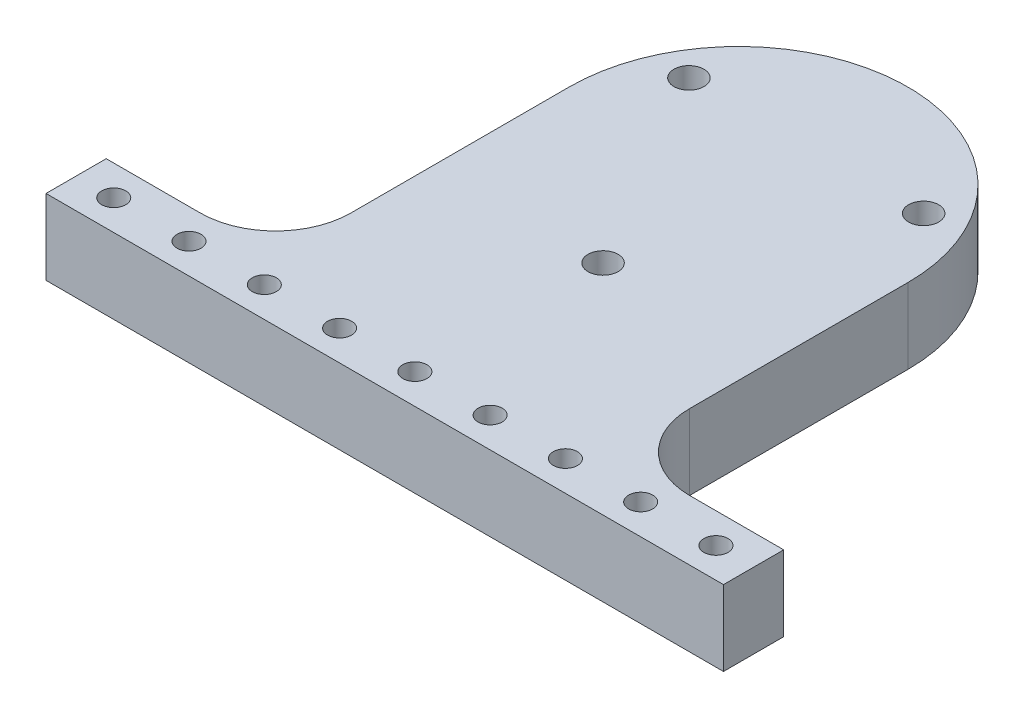
ISO-10303-21;
HEADER;
FILE_DESCRIPTION(('STEP AP214'),'2;1');
FILE_NAME('part.step','',(''),(''),'','','');
FILE_SCHEMA(('AUTOMOTIVE_DESIGN { 1 0 10303 214 1 1 1 1 }'));
ENDSEC;
DATA;
#1=APPLICATION_CONTEXT('core data for automotive mechanical design processes');
#2=APPLICATION_PROTOCOL_DEFINITION('international standard','automotive_design',2000,#1);
#3=PRODUCT_CONTEXT('',#1,'mechanical');
#4=PRODUCT('Part','Part','',(#3));
#5=PRODUCT_RELATED_PRODUCT_CATEGORY('part','',(#4));
#6=PRODUCT_DEFINITION_FORMATION('','',#4);
#7=PRODUCT_DEFINITION_CONTEXT('part definition',#1,'design');
#8=PRODUCT_DEFINITION('design','',#6,#7);
#9=PRODUCT_DEFINITION_SHAPE('','',#8);
#10=(LENGTH_UNIT() NAMED_UNIT(*) SI_UNIT(.MILLI.,.METRE.));
#11=(NAMED_UNIT(*) PLANE_ANGLE_UNIT() SI_UNIT($,.RADIAN.));
#12=(NAMED_UNIT(*) SI_UNIT($,.STERADIAN.) SOLID_ANGLE_UNIT());
#13=UNCERTAINTY_MEASURE_WITH_UNIT(LENGTH_MEASURE(1.E-05),#10,'distance_accuracy_value','');
#14=(GEOMETRIC_REPRESENTATION_CONTEXT(3) GLOBAL_UNCERTAINTY_ASSIGNED_CONTEXT((#13)) GLOBAL_UNIT_ASSIGNED_CONTEXT((#10,
#11,#12)) REPRESENTATION_CONTEXT('',''));
#15=CARTESIAN_POINT('',(0.,0.,0.));
#16=DIRECTION('',(0.,0.,1.));
#17=DIRECTION('',(1.,0.,0.));
#18=AXIS2_PLACEMENT_3D('',#15,#16,#17);
#19=CARTESIAN_POINT('',(40.,0.,0.));
#20=DIRECTION('',(0.,1.,0.));
#21=DIRECTION('',(0.,0.,1.));
#22=AXIS2_PLACEMENT_3D('',#19,#20,#21);
#23=CYLINDRICAL_SURFACE('',#22,1.6);
#24=CARTESIAN_POINT('',(40.,0.,0.));
#25=DIRECTION('',(0.,1.,0.));
#26=DIRECTION('',(0.,0.,1.));
#27=AXIS2_PLACEMENT_3D('',#24,#25,#26);
#28=CIRCLE('',#27,1.6);
#29=CARTESIAN_POINT('',(40.,0.,1.6));
#30=VERTEX_POINT('',#29);
#31=EDGE_CURVE('E44',#30,#30,#28,.T.);
#32=ORIENTED_EDGE('',*,*,#31,.F.);
#33=EDGE_LOOP('',(#32));
#34=FACE_BOUND('',#33,.T.);
#35=CARTESIAN_POINT('',(40.,10.,0.));
#36=DIRECTION('',(0.,1.,0.));
#37=DIRECTION('',(0.,0.,1.));
#38=AXIS2_PLACEMENT_3D('',#35,#36,#37);
#39=CIRCLE('',#38,1.6);
#40=CARTESIAN_POINT('',(40.,10.,1.6));
#41=VERTEX_POINT('',#40);
#42=EDGE_CURVE('E11',#41,#41,#39,.T.);
#43=ORIENTED_EDGE('',*,*,#42,.T.);
#44=EDGE_LOOP('',(#43));
#45=FACE_BOUND('',#44,.T.);
#46=ADVANCED_FACE('F37',(#34,#45),#23,.F.);
#47=CARTESIAN_POINT('',(30.,0.,0.));
#48=DIRECTION('',(0.,1.,0.));
#49=DIRECTION('',(0.,0.,1.));
#50=AXIS2_PLACEMENT_3D('',#47,#48,#49);
#51=CYLINDRICAL_SURFACE('',#50,1.6);
#52=CARTESIAN_POINT('',(30.,0.,0.));
#53=DIRECTION('',(0.,1.,0.));
#54=DIRECTION('',(0.,0.,1.));
#55=AXIS2_PLACEMENT_3D('',#52,#53,#54);
#56=CIRCLE('',#55,1.6);
#57=CARTESIAN_POINT('',(30.,0.,1.6));
#58=VERTEX_POINT('',#57);
#59=EDGE_CURVE('E227',#58,#58,#56,.T.);
#60=ORIENTED_EDGE('',*,*,#59,.F.);
#61=EDGE_LOOP('',(#60));
#62=FACE_BOUND('',#61,.T.);
#63=CARTESIAN_POINT('',(30.,10.,0.));
#64=DIRECTION('',(0.,1.,0.));
#65=DIRECTION('',(0.,0.,1.));
#66=AXIS2_PLACEMENT_3D('',#63,#64,#65);
#67=CIRCLE('',#66,1.6);
#68=CARTESIAN_POINT('',(30.,10.,1.6));
#69=VERTEX_POINT('',#68);
#70=EDGE_CURVE('E230',#69,#69,#67,.T.);
#71=ORIENTED_EDGE('',*,*,#70,.T.);
#72=EDGE_LOOP('',(#71));
#73=FACE_BOUND('',#72,.T.);
#74=ADVANCED_FACE('F238',(#62,#73),#51,.F.);
#75=CARTESIAN_POINT('',(20.,0.,0.));
#76=DIRECTION('',(0.,1.,0.));
#77=DIRECTION('',(0.,0.,1.));
#78=AXIS2_PLACEMENT_3D('',#75,#76,#77);
#79=CYLINDRICAL_SURFACE('',#78,1.6);
#80=CARTESIAN_POINT('',(20.,0.,0.));
#81=DIRECTION('',(0.,1.,0.));
#82=DIRECTION('',(0.,0.,1.));
#83=AXIS2_PLACEMENT_3D('',#80,#81,#82);
#84=CIRCLE('',#83,1.6);
#85=CARTESIAN_POINT('',(20.,0.,1.6));
#86=VERTEX_POINT('',#85);
#87=EDGE_CURVE('E221',#86,#86,#84,.T.);
#88=ORIENTED_EDGE('',*,*,#87,.F.);
#89=EDGE_LOOP('',(#88));
#90=FACE_BOUND('',#89,.T.);
#91=CARTESIAN_POINT('',(20.,10.,0.));
#92=DIRECTION('',(0.,1.,0.));
#93=DIRECTION('',(0.,0.,1.));
#94=AXIS2_PLACEMENT_3D('',#91,#92,#93);
#95=CIRCLE('',#94,1.6);
#96=CARTESIAN_POINT('',(20.,10.,1.6));
#97=VERTEX_POINT('',#96);
#98=EDGE_CURVE('E224',#97,#97,#95,.T.);
#99=ORIENTED_EDGE('',*,*,#98,.T.);
#100=EDGE_LOOP('',(#99));
#101=FACE_BOUND('',#100,.T.);
#102=ADVANCED_FACE('F298',(#90,#101),#79,.F.);
#103=CARTESIAN_POINT('',(10.,0.,0.));
#104=DIRECTION('',(0.,1.,0.));
#105=DIRECTION('',(0.,0.,1.));
#106=AXIS2_PLACEMENT_3D('',#103,#104,#105);
#107=CYLINDRICAL_SURFACE('',#106,1.6);
#108=CARTESIAN_POINT('',(10.,0.,0.));
#109=DIRECTION('',(0.,1.,0.));
#110=DIRECTION('',(0.,0.,1.));
#111=AXIS2_PLACEMENT_3D('',#108,#109,#110);
#112=CIRCLE('',#111,1.6);
#113=CARTESIAN_POINT('',(10.,0.,1.6));
#114=VERTEX_POINT('',#113);
#115=EDGE_CURVE('E215',#114,#114,#112,.T.);
#116=ORIENTED_EDGE('',*,*,#115,.F.);
#117=EDGE_LOOP('',(#116));
#118=FACE_BOUND('',#117,.T.);
#119=CARTESIAN_POINT('',(10.,10.,0.));
#120=DIRECTION('',(0.,1.,0.));
#121=DIRECTION('',(0.,0.,1.));
#122=AXIS2_PLACEMENT_3D('',#119,#120,#121);
#123=CIRCLE('',#122,1.6);
#124=CARTESIAN_POINT('',(10.,10.,1.6));
#125=VERTEX_POINT('',#124);
#126=EDGE_CURVE('E218',#125,#125,#123,.T.);
#127=ORIENTED_EDGE('',*,*,#126,.T.);
#128=EDGE_LOOP('',(#127));
#129=FACE_BOUND('',#128,.T.);
#130=ADVANCED_FACE('F294',(#118,#129),#107,.F.);
#131=CARTESIAN_POINT('',(0.,0.,0.));
#132=DIRECTION('',(0.,1.,0.));
#133=DIRECTION('',(0.,0.,1.));
#134=AXIS2_PLACEMENT_3D('',#131,#132,#133);
#135=CYLINDRICAL_SURFACE('',#134,1.6);
#136=CARTESIAN_POINT('',(0.,0.,0.));
#137=DIRECTION('',(0.,1.,0.));
#138=DIRECTION('',(0.,0.,1.));
#139=AXIS2_PLACEMENT_3D('',#136,#137,#138);
#140=CIRCLE('',#139,1.6);
#141=CARTESIAN_POINT('',(0.,0.,1.6));
#142=VERTEX_POINT('',#141);
#143=EDGE_CURVE('E209',#142,#142,#140,.T.);
#144=ORIENTED_EDGE('',*,*,#143,.F.);
#145=EDGE_LOOP('',(#144));
#146=FACE_BOUND('',#145,.T.);
#147=CARTESIAN_POINT('',(0.,10.,0.));
#148=DIRECTION('',(0.,1.,0.));
#149=DIRECTION('',(0.,0.,1.));
#150=AXIS2_PLACEMENT_3D('',#147,#148,#149);
#151=CIRCLE('',#150,1.6);
#152=CARTESIAN_POINT('',(0.,10.,1.6));
#153=VERTEX_POINT('',#152);
#154=EDGE_CURVE('E212',#153,#153,#151,.T.);
#155=ORIENTED_EDGE('',*,*,#154,.T.);
#156=EDGE_LOOP('',(#155));
#157=FACE_BOUND('',#156,.T.);
#158=ADVANCED_FACE('F290',(#146,#157),#135,.F.);
#159=CARTESIAN_POINT('',(-10.,0.,0.));
#160=DIRECTION('',(0.,1.,0.));
#161=DIRECTION('',(0.,0.,1.));
#162=AXIS2_PLACEMENT_3D('',#159,#160,#161);
#163=CYLINDRICAL_SURFACE('',#162,1.6);
#164=CARTESIAN_POINT('',(-10.,0.,0.));
#165=DIRECTION('',(0.,1.,0.));
#166=DIRECTION('',(0.,0.,1.));
#167=AXIS2_PLACEMENT_3D('',#164,#165,#166);
#168=CIRCLE('',#167,1.6);
#169=CARTESIAN_POINT('',(-10.,0.,1.6));
#170=VERTEX_POINT('',#169);
#171=EDGE_CURVE('E203',#170,#170,#168,.T.);
#172=ORIENTED_EDGE('',*,*,#171,.F.);
#173=EDGE_LOOP('',(#172));
#174=FACE_BOUND('',#173,.T.);
#175=CARTESIAN_POINT('',(-10.,10.,0.));
#176=DIRECTION('',(0.,1.,0.));
#177=DIRECTION('',(0.,0.,1.));
#178=AXIS2_PLACEMENT_3D('',#175,#176,#177);
#179=CIRCLE('',#178,1.6);
#180=CARTESIAN_POINT('',(-10.,10.,1.6));
#181=VERTEX_POINT('',#180);
#182=EDGE_CURVE('E206',#181,#181,#179,.T.);
#183=ORIENTED_EDGE('',*,*,#182,.T.);
#184=EDGE_LOOP('',(#183));
#185=FACE_BOUND('',#184,.T.);
#186=ADVANCED_FACE('F286',(#174,#185),#163,.F.);
#187=CARTESIAN_POINT('',(-20.,0.,0.));
#188=DIRECTION('',(0.,1.,0.));
#189=DIRECTION('',(0.,0.,1.));
#190=AXIS2_PLACEMENT_3D('',#187,#188,#189);
#191=CYLINDRICAL_SURFACE('',#190,1.6);
#192=CARTESIAN_POINT('',(-20.,0.,0.));
#193=DIRECTION('',(0.,1.,0.));
#194=DIRECTION('',(0.,0.,1.));
#195=AXIS2_PLACEMENT_3D('',#192,#193,#194);
#196=CIRCLE('',#195,1.6);
#197=CARTESIAN_POINT('',(-20.,0.,1.6));
#198=VERTEX_POINT('',#197);
#199=EDGE_CURVE('E197',#198,#198,#196,.T.);
#200=ORIENTED_EDGE('',*,*,#199,.F.);
#201=EDGE_LOOP('',(#200));
#202=FACE_BOUND('',#201,.T.);
#203=CARTESIAN_POINT('',(-20.,10.,0.));
#204=DIRECTION('',(0.,1.,0.));
#205=DIRECTION('',(0.,0.,1.));
#206=AXIS2_PLACEMENT_3D('',#203,#204,#205);
#207=CIRCLE('',#206,1.6);
#208=CARTESIAN_POINT('',(-20.,10.,1.6));
#209=VERTEX_POINT('',#208);
#210=EDGE_CURVE('E200',#209,#209,#207,.T.);
#211=ORIENTED_EDGE('',*,*,#210,.T.);
#212=EDGE_LOOP('',(#211));
#213=FACE_BOUND('',#212,.T.);
#214=ADVANCED_FACE('F283',(#202,#213),#191,.F.);
#215=CARTESIAN_POINT('',(-45.,10.,-4.));
#216=DIRECTION('',(0.,0.,1.));
#217=DIRECTION('',(1.,0.,0.));
#218=AXIS2_PLACEMENT_3D('',#215,#216,#217);
#219=PLANE('',#218);
#220=DIRECTION('',(-1.,0.,0.));
#221=VECTOR('',#220,1.);
#222=CARTESIAN_POINT('',(-45.,0.,-4.));
#223=LINE('',#222,#221);
#224=CARTESIAN_POINT('',(45.,0.,-4.));
#225=VERTEX_POINT('',#224);
#226=CARTESIAN_POINT('',(32.5,0.,-4.));
#227=VERTEX_POINT('',#226);
#228=EDGE_CURVE('E164',#225,#227,#223,.T.);
#229=ORIENTED_EDGE('',*,*,#228,.T.);
#230=DIRECTION('',(0.,-1.,0.));
#231=VECTOR('',#230,1.);
#232=CARTESIAN_POINT('',(32.5,9.99999999999999,-4.));
#233=LINE('',#232,#231);
#234=CARTESIAN_POINT('',(32.5,10.,-4.));
#235=VERTEX_POINT('',#234);
#236=EDGE_CURVE('E184',#227,#235,#233,.F.);
#237=ORIENTED_EDGE('',*,*,#236,.T.);
#238=DIRECTION('',(-1.,0.,0.));
#239=VECTOR('',#238,1.);
#240=CARTESIAN_POINT('',(-45.,10.,-4.));
#241=LINE('',#240,#239);
#242=CARTESIAN_POINT('',(45.,10.,-4.));
#243=VERTEX_POINT('',#242);
#244=EDGE_CURVE('E152',#243,#235,#241,.T.);
#245=ORIENTED_EDGE('',*,*,#244,.F.);
#246=DIRECTION('',(0.,-1.,0.));
#247=VECTOR('',#246,1.);
#248=CARTESIAN_POINT('',(45.,10.,-4.));
#249=LINE('',#248,#247);
#250=EDGE_CURVE('E178',#243,#225,#249,.T.);
#251=ORIENTED_EDGE('',*,*,#250,.T.);
#252=EDGE_LOOP('',(#229,#237,#245,#251));
#253=FACE_BOUND('',#252,.T.);
#254=ADVANCED_FACE('F269',(#253),#219,.F.);
#255=CARTESIAN_POINT('',(45.,10.,4.));
#256=DIRECTION('',(-1.,0.,0.));
#257=DIRECTION('',(0.,0.,1.));
#258=AXIS2_PLACEMENT_3D('',#255,#256,#257);
#259=PLANE('',#258);
#260=DIRECTION('',(0.,0.,-1.));
#261=VECTOR('',#260,1.);
#262=CARTESIAN_POINT('',(45.,0.,4.));
#263=LINE('',#262,#261);
#264=CARTESIAN_POINT('',(45.,0.,4.));
#265=VERTEX_POINT('',#264);
#266=EDGE_CURVE('E160',#265,#225,#263,.T.);
#267=ORIENTED_EDGE('',*,*,#266,.T.);
#268=ORIENTED_EDGE('',*,*,#250,.F.);
#269=DIRECTION('',(0.,0.,-1.));
#270=VECTOR('',#269,1.);
#271=CARTESIAN_POINT('',(45.,10.,4.));
#272=LINE('',#271,#270);
#273=CARTESIAN_POINT('',(45.,10.,4.));
#274=VERTEX_POINT('',#273);
#275=EDGE_CURVE('E147',#274,#243,#272,.T.);
#276=ORIENTED_EDGE('',*,*,#275,.F.);
#277=DIRECTION('',(0.,-1.,0.));
#278=VECTOR('',#277,1.);
#279=CARTESIAN_POINT('',(45.,10.,4.));
#280=LINE('',#279,#278);
#281=EDGE_CURVE('E159',#274,#265,#280,.T.);
#282=ORIENTED_EDGE('',*,*,#281,.T.);
#283=EDGE_LOOP('',(#267,#268,#276,#282));
#284=FACE_BOUND('',#283,.T.);
#285=ADVANCED_FACE('F267',(#284),#259,.F.);
#286=CARTESIAN_POINT('',(-32.5,10.,-4.));
#287=VERTEX_POINT('',#286);
#288=CARTESIAN_POINT('',(-45.,10.,-4.));
#289=VERTEX_POINT('',#288);
#290=EDGE_CURVE('E150',#287,#289,#241,.T.);
#291=ORIENTED_EDGE('',*,*,#290,.F.);
#292=DIRECTION('',(0.,-1.,0.));
#293=VECTOR('',#292,1.);
#294=CARTESIAN_POINT('',(-32.5,0.,-4.));
#295=LINE('',#294,#293);
#296=CARTESIAN_POINT('',(-32.5,0.,-4.));
#297=VERTEX_POINT('',#296);
#298=EDGE_CURVE('E186',#287,#297,#295,.T.);
#299=ORIENTED_EDGE('',*,*,#298,.T.);
#300=CARTESIAN_POINT('',(-45.,0.,-4.));
#301=VERTEX_POINT('',#300);
#302=EDGE_CURVE('E163',#297,#301,#223,.T.);
#303=ORIENTED_EDGE('',*,*,#302,.T.);
#304=DIRECTION('',(0.,-1.,0.));
#305=VECTOR('',#304,1.);
#306=CARTESIAN_POINT('',(-45.,10.,-4.));
#307=LINE('',#306,#305);
#308=EDGE_CURVE('E175',#289,#301,#307,.T.);
#309=ORIENTED_EDGE('',*,*,#308,.F.);
#310=EDGE_LOOP('',(#291,#299,#303,#309));
#311=FACE_BOUND('',#310,.T.);
#312=ADVANCED_FACE('F263',(#311),#219,.F.);
#313=CARTESIAN_POINT('',(-45.,10.,4.));
#314=DIRECTION('',(1.,0.,0.));
#315=DIRECTION('',(0.,0.,-1.));
#316=AXIS2_PLACEMENT_3D('',#313,#314,#315);
#317=PLANE('',#316);
#318=DIRECTION('',(0.,0.,1.));
#319=VECTOR('',#318,1.);
#320=CARTESIAN_POINT('',(-45.,0.,4.));
#321=LINE('',#320,#319);
#322=CARTESIAN_POINT('',(-45.,0.,4.));
#323=VERTEX_POINT('',#322);
#324=EDGE_CURVE('E167',#301,#323,#321,.T.);
#325=ORIENTED_EDGE('',*,*,#324,.T.);
#326=DIRECTION('',(0.,-1.,0.));
#327=VECTOR('',#326,1.);
#328=CARTESIAN_POINT('',(-45.,10.,4.));
#329=LINE('',#328,#327);
#330=CARTESIAN_POINT('',(-45.,10.,4.));
#331=VERTEX_POINT('',#330);
#332=EDGE_CURVE('E172',#331,#323,#329,.T.);
#333=ORIENTED_EDGE('',*,*,#332,.F.);
#334=DIRECTION('',(0.,0.,1.));
#335=VECTOR('',#334,1.);
#336=CARTESIAN_POINT('',(-45.,10.,4.));
#337=LINE('',#336,#335);
#338=EDGE_CURVE('E155',#289,#331,#337,.T.);
#339=ORIENTED_EDGE('',*,*,#338,.F.);
#340=ORIENTED_EDGE('',*,*,#308,.T.);
#341=EDGE_LOOP('',(#325,#333,#339,#340));
#342=FACE_BOUND('',#341,.T.);
#343=ADVANCED_FACE('F253',(#342),#317,.F.);
#344=CARTESIAN_POINT('',(-45.,10.,4.));
#345=DIRECTION('',(0.,0.,-1.));
#346=DIRECTION('',(-1.,0.,0.));
#347=AXIS2_PLACEMENT_3D('',#344,#345,#346);
#348=PLANE('',#347);
#349=DIRECTION('',(1.,0.,0.));
#350=VECTOR('',#349,1.);
#351=CARTESIAN_POINT('',(-45.,0.,4.));
#352=LINE('',#351,#350);
#353=EDGE_CURVE('E151',#323,#265,#352,.T.);
#354=ORIENTED_EDGE('',*,*,#353,.T.);
#355=ORIENTED_EDGE('',*,*,#281,.F.);
#356=DIRECTION('',(1.,0.,0.));
#357=VECTOR('',#356,1.);
#358=CARTESIAN_POINT('',(-45.,10.,4.));
#359=LINE('',#358,#357);
#360=EDGE_CURVE('E157',#331,#274,#359,.T.);
#361=ORIENTED_EDGE('',*,*,#360,.F.);
#362=ORIENTED_EDGE('',*,*,#332,.T.);
#363=EDGE_LOOP('',(#354,#355,#361,#362));
#364=FACE_BOUND('',#363,.T.);
#365=ADVANCED_FACE('F243',(#364),#348,.F.);
#366=CARTESIAN_POINT('',(0.,10.,0.));
#367=DIRECTION('',(0.,-1.,0.));
#368=DIRECTION('',(0.,0.,-1.));
#369=AXIS2_PLACEMENT_3D('',#366,#367,#368);
#370=PLANE('',#369);
#371=CARTESIAN_POINT('',(-30.,10.,0.));
#372=DIRECTION('',(0.,1.,0.));
#373=DIRECTION('',(0.,0.,1.));
#374=AXIS2_PLACEMENT_3D('',#371,#372,#373);
#375=CIRCLE('',#374,1.6);
#376=CARTESIAN_POINT('',(-30.,10.,1.6));
#377=VERTEX_POINT('',#376);
#378=EDGE_CURVE('E566',#377,#377,#375,.T.);
#379=ORIENTED_EDGE('',*,*,#378,.F.);
#380=EDGE_LOOP('',(#379));
#381=FACE_BOUND('',#380,.T.);
#382=CARTESIAN_POINT('',(-40.,10.,0.));
#383=DIRECTION('',(0.,1.,0.));
#384=DIRECTION('',(0.,0.,1.));
#385=AXIS2_PLACEMENT_3D('',#382,#383,#384);
#386=CIRCLE('',#385,1.6);
#387=CARTESIAN_POINT('',(-40.,10.,1.6));
#388=VERTEX_POINT('',#387);
#389=EDGE_CURVE('E563',#388,#388,#386,.T.);
#390=ORIENTED_EDGE('',*,*,#389,.F.);
#391=EDGE_LOOP('',(#390));
#392=FACE_BOUND('',#391,.T.);
#393=CARTESIAN_POINT('',(-15.5885,10.,-52.0000740137874));
#394=DIRECTION('',(0.,1.,0.));
#395=DIRECTION('',(0.,0.,1.));
#396=AXIS2_PLACEMENT_3D('',#393,#394,#395);
#397=CIRCLE('',#396,2.);
#398=CARTESIAN_POINT('',(-15.5885,10.,-50.0000740137874));
#399=VERTEX_POINT('',#398);
#400=EDGE_CURVE('E137',#399,#399,#397,.T.);
#401=ORIENTED_EDGE('',*,*,#400,.F.);
#402=EDGE_LOOP('',(#401));
#403=FACE_BOUND('',#402,.T.);
#404=CARTESIAN_POINT('',(15.5885,10.,-52.0000740137874));
#405=DIRECTION('',(0.,1.,0.));
#406=DIRECTION('',(0.,0.,1.));
#407=AXIS2_PLACEMENT_3D('',#404,#405,#406);
#408=CIRCLE('',#407,2.);
#409=CARTESIAN_POINT('',(15.5885,10.,-50.0000740137874));
#410=VERTEX_POINT('',#409);
#411=EDGE_CURVE('E558',#410,#410,#408,.T.);
#412=ORIENTED_EDGE('',*,*,#411,.F.);
#413=EDGE_LOOP('',(#412));
#414=FACE_BOUND('',#413,.T.);
#415=CARTESIAN_POINT('',(0.,10.,-25.));
#416=DIRECTION('',(0.,1.,0.));
#417=DIRECTION('',(0.,0.,1.));
#418=AXIS2_PLACEMENT_3D('',#415,#416,#417);
#419=CIRCLE('',#418,2.);
#420=CARTESIAN_POINT('',(0.,10.,-23.));
#421=VERTEX_POINT('',#420);
#422=EDGE_CURVE('E551',#421,#421,#419,.T.);
#423=ORIENTED_EDGE('',*,*,#422,.F.);
#424=EDGE_LOOP('',(#423));
#425=FACE_BOUND('',#424,.T.);
#426=ORIENTED_EDGE('',*,*,#275,.T.);
#427=ORIENTED_EDGE('',*,*,#244,.T.);
#428=CARTESIAN_POINT('',(32.5,9.99999999999999,-14.));
#429=DIRECTION('',(0.,-1.,0.));
#430=DIRECTION('',(0.,0.,-1.));
#431=AXIS2_PLACEMENT_3D('',#428,#429,#430);
#432=CIRCLE('',#431,10.);
#433=CARTESIAN_POINT('',(22.5,9.99999999999999,-14.));
#434=VERTEX_POINT('',#433);
#435=EDGE_CURVE('E192',#235,#434,#432,.T.);
#436=ORIENTED_EDGE('',*,*,#435,.T.);
#437=DIRECTION('',(0.,0.,1.));
#438=VECTOR('',#437,1.);
#439=CARTESIAN_POINT('',(22.5,9.99999999999999,-4.));
#440=LINE('',#439,#438);
#441=CARTESIAN_POINT('',(22.5,9.99999999999999,-43.000049342525));
#442=VERTEX_POINT('',#441);
#443=EDGE_CURVE('E120',#442,#434,#440,.T.);
#444=ORIENTED_EDGE('',*,*,#443,.F.);
#445=CARTESIAN_POINT('',(0.,9.99999999999999,-43.000049342525));
#446=DIRECTION('',(0.,-1.,0.));
#447=DIRECTION('',(0.,0.,-1.));
#448=AXIS2_PLACEMENT_3D('',#445,#446,#447);
#449=CIRCLE('',#448,22.5);
#450=CARTESIAN_POINT('',(-22.5,9.99999999999999,-43.000049342525));
#451=VERTEX_POINT('',#450);
#452=EDGE_CURVE('E140',#451,#442,#449,.T.);
#453=ORIENTED_EDGE('',*,*,#452,.F.);
#454=DIRECTION('',(0.,0.,-1.));
#455=VECTOR('',#454,1.);
#456=CARTESIAN_POINT('',(-22.5,9.99999999999999,-43.000049342525));
#457=LINE('',#456,#455);
#458=CARTESIAN_POINT('',(-22.5,9.99999999999999,-14.));
#459=VERTEX_POINT('',#458);
#460=EDGE_CURVE('E115',#459,#451,#457,.T.);
#461=ORIENTED_EDGE('',*,*,#460,.F.);
#462=CARTESIAN_POINT('',(-32.5,10.,-14.));
#463=DIRECTION('',(0.,-1.,0.));
#464=DIRECTION('',(0.,0.,-1.));
#465=AXIS2_PLACEMENT_3D('',#462,#463,#464);
#466=CIRCLE('',#465,10.);
#467=EDGE_CURVE('E195',#459,#287,#466,.T.);
#468=ORIENTED_EDGE('',*,*,#467,.T.);
#469=ORIENTED_EDGE('',*,*,#290,.T.);
#470=ORIENTED_EDGE('',*,*,#338,.T.);
#471=ORIENTED_EDGE('',*,*,#360,.T.);
#472=EDGE_LOOP('',(#426,#427,#436,#444,#453,#461,#468,#469,#470,#471));
#473=FACE_BOUND('',#472,.T.);
#474=ORIENTED_EDGE('',*,*,#210,.F.);
#475=EDGE_LOOP('',(#474));
#476=FACE_BOUND('',#475,.T.);
#477=ORIENTED_EDGE('',*,*,#182,.F.);
#478=EDGE_LOOP('',(#477));
#479=FACE_BOUND('',#478,.T.);
#480=ORIENTED_EDGE('',*,*,#154,.F.);
#481=EDGE_LOOP('',(#480));
#482=FACE_BOUND('',#481,.T.);
#483=ORIENTED_EDGE('',*,*,#126,.F.);
#484=EDGE_LOOP('',(#483));
#485=FACE_BOUND('',#484,.T.);
#486=ORIENTED_EDGE('',*,*,#98,.F.);
#487=EDGE_LOOP('',(#486));
#488=FACE_BOUND('',#487,.T.);
#489=ORIENTED_EDGE('',*,*,#70,.F.);
#490=EDGE_LOOP('',(#489));
#491=FACE_BOUND('',#490,.T.);
#492=ORIENTED_EDGE('',*,*,#42,.F.);
#493=EDGE_LOOP('',(#492));
#494=FACE_BOUND('',#493,.T.);
#495=ADVANCED_FACE('F241',(#381,#392,#403,#414,#425,#473,#476,#479,#482,#485,#488,#491,#494),
#370,.F.);
#496=CARTESIAN_POINT('',(0.,0.,0.));
#497=DIRECTION('',(0.,-1.,0.));
#498=DIRECTION('',(0.,0.,-1.));
#499=AXIS2_PLACEMENT_3D('',#496,#497,#498);
#500=PLANE('',#499);
#501=CARTESIAN_POINT('',(-30.,0.,0.));
#502=DIRECTION('',(0.,1.,0.));
#503=DIRECTION('',(0.,0.,1.));
#504=AXIS2_PLACEMENT_3D('',#501,#502,#503);
#505=CIRCLE('',#504,1.6);
#506=CARTESIAN_POINT('',(-30.,0.,1.6));
#507=VERTEX_POINT('',#506);
#508=EDGE_CURVE('E571',#507,#507,#505,.T.);
#509=ORIENTED_EDGE('',*,*,#508,.T.);
#510=EDGE_LOOP('',(#509));
#511=FACE_BOUND('',#510,.T.);
#512=CARTESIAN_POINT('',(-40.,0.,0.));
#513=DIRECTION('',(0.,1.,0.));
#514=DIRECTION('',(0.,0.,1.));
#515=AXIS2_PLACEMENT_3D('',#512,#513,#514);
#516=CIRCLE('',#515,1.6);
#517=CARTESIAN_POINT('',(-40.,0.,1.6));
#518=VERTEX_POINT('',#517);
#519=EDGE_CURVE('E552',#518,#518,#516,.T.);
#520=ORIENTED_EDGE('',*,*,#519,.T.);
#521=EDGE_LOOP('',(#520));
#522=FACE_BOUND('',#521,.T.);
#523=CARTESIAN_POINT('',(-15.5885,0.,-52.0000740137874));
#524=DIRECTION('',(0.,1.,0.));
#525=DIRECTION('',(0.,0.,1.));
#526=AXIS2_PLACEMENT_3D('',#523,#524,#525);
#527=CIRCLE('',#526,2.);
#528=CARTESIAN_POINT('',(-15.5885,0.,-50.0000740137874));
#529=VERTEX_POINT('',#528);
#530=EDGE_CURVE('E134',#529,#529,#527,.T.);
#531=ORIENTED_EDGE('',*,*,#530,.T.);
#532=EDGE_LOOP('',(#531));
#533=FACE_BOUND('',#532,.T.);
#534=CARTESIAN_POINT('',(15.5885,0.,-52.0000740137874));
#535=DIRECTION('',(0.,1.,0.));
#536=DIRECTION('',(0.,0.,1.));
#537=AXIS2_PLACEMENT_3D('',#534,#535,#536);
#538=CIRCLE('',#537,2.);
#539=CARTESIAN_POINT('',(15.5885,0.,-50.0000740137874));
#540=VERTEX_POINT('',#539);
#541=EDGE_CURVE('E555',#540,#540,#538,.T.);
#542=ORIENTED_EDGE('',*,*,#541,.T.);
#543=EDGE_LOOP('',(#542));
#544=FACE_BOUND('',#543,.T.);
#545=CARTESIAN_POINT('',(0.,0.,-25.));
#546=DIRECTION('',(0.,1.,0.));
#547=DIRECTION('',(0.,0.,1.));
#548=AXIS2_PLACEMENT_3D('',#545,#546,#547);
#549=CIRCLE('',#548,2.);
#550=CARTESIAN_POINT('',(0.,0.,-23.));
#551=VERTEX_POINT('',#550);
#552=EDGE_CURVE('E548',#551,#551,#549,.T.);
#553=ORIENTED_EDGE('',*,*,#552,.T.);
#554=EDGE_LOOP('',(#553));
#555=FACE_BOUND('',#554,.T.);
#556=ORIENTED_EDGE('',*,*,#266,.F.);
#557=ORIENTED_EDGE('',*,*,#353,.F.);
#558=ORIENTED_EDGE('',*,*,#324,.F.);
#559=ORIENTED_EDGE('',*,*,#302,.F.);
#560=CARTESIAN_POINT('',(-32.5,0.,-14.));
#561=DIRECTION('',(0.,-1.,0.));
#562=DIRECTION('',(0.,0.,-1.));
#563=AXIS2_PLACEMENT_3D('',#560,#561,#562);
#564=CIRCLE('',#563,10.);
#565=CARTESIAN_POINT('',(-22.5,0.,-14.));
#566=VERTEX_POINT('',#565);
#567=EDGE_CURVE('E51',#297,#566,#564,.F.);
#568=ORIENTED_EDGE('',*,*,#567,.T.);
#569=DIRECTION('',(0.,0.,1.));
#570=VECTOR('',#569,1.);
#571=CARTESIAN_POINT('',(-22.5,0.,-43.000049342525));
#572=LINE('',#571,#570);
#573=CARTESIAN_POINT('',(-22.5,0.,-43.000049342525));
#574=VERTEX_POINT('',#573);
#575=EDGE_CURVE('E114',#574,#566,#572,.T.);
#576=ORIENTED_EDGE('',*,*,#575,.F.);
#577=CARTESIAN_POINT('',(0.,0.,-43.000049342525));
#578=DIRECTION('',(0.,1.,0.));
#579=DIRECTION('',(0.,0.,1.));
#580=AXIS2_PLACEMENT_3D('',#577,#578,#579);
#581=CIRCLE('',#580,22.5);
#582=CARTESIAN_POINT('',(22.5,0.,-43.000049342525));
#583=VERTEX_POINT('',#582);
#584=EDGE_CURVE('E128',#583,#574,#581,.T.);
#585=ORIENTED_EDGE('',*,*,#584,.F.);
#586=DIRECTION('',(0.,0.,-1.));
#587=VECTOR('',#586,1.);
#588=CARTESIAN_POINT('',(22.5,0.,-4.));
#589=LINE('',#588,#587);
#590=CARTESIAN_POINT('',(22.5,0.,-14.));
#591=VERTEX_POINT('',#590);
#592=EDGE_CURVE('E129',#591,#583,#589,.T.);
#593=ORIENTED_EDGE('',*,*,#592,.F.);
#594=CARTESIAN_POINT('',(32.5,0.,-14.));
#595=DIRECTION('',(0.,-1.,0.));
#596=DIRECTION('',(0.,0.,-1.));
#597=AXIS2_PLACEMENT_3D('',#594,#595,#596);
#598=CIRCLE('',#597,10.);
#599=EDGE_CURVE('E190',#591,#227,#598,.F.);
#600=ORIENTED_EDGE('',*,*,#599,.T.);
#601=ORIENTED_EDGE('',*,*,#228,.F.);
#602=EDGE_LOOP('',(#556,#557,#558,#559,#568,#576,#585,#593,#600,#601));
#603=FACE_BOUND('',#602,.T.);
#604=ORIENTED_EDGE('',*,*,#199,.T.);
#605=EDGE_LOOP('',(#604));
#606=FACE_BOUND('',#605,.T.);
#607=ORIENTED_EDGE('',*,*,#171,.T.);
#608=EDGE_LOOP('',(#607));
#609=FACE_BOUND('',#608,.T.);
#610=ORIENTED_EDGE('',*,*,#143,.T.);
#611=EDGE_LOOP('',(#610));
#612=FACE_BOUND('',#611,.T.);
#613=ORIENTED_EDGE('',*,*,#115,.T.);
#614=EDGE_LOOP('',(#613));
#615=FACE_BOUND('',#614,.T.);
#616=ORIENTED_EDGE('',*,*,#87,.T.);
#617=EDGE_LOOP('',(#616));
#618=FACE_BOUND('',#617,.T.);
#619=ORIENTED_EDGE('',*,*,#59,.T.);
#620=EDGE_LOOP('',(#619));
#621=FACE_BOUND('',#620,.T.);
#622=ORIENTED_EDGE('',*,*,#31,.T.);
#623=EDGE_LOOP('',(#622));
#624=FACE_BOUND('',#623,.T.);
#625=ADVANCED_FACE('F125',(#511,#522,#533,#544,#555,#603,#606,#609,#612,#615,#618,#621,#624),
#500,.T.);
#626=CARTESIAN_POINT('',(22.5,86.2053545962028,-4.));
#627=DIRECTION('',(-1.,0.,0.));
#628=DIRECTION('',(0.,0.,1.));
#629=AXIS2_PLACEMENT_3D('',#626,#627,#628);
#630=PLANE('',#629);
#631=ORIENTED_EDGE('',*,*,#443,.T.);
#632=DIRECTION('',(0.,-1.,0.));
#633=VECTOR('',#632,1.);
#634=CARTESIAN_POINT('',(22.5,0.,-14.));
#635=LINE('',#634,#633);
#636=EDGE_CURVE('E181',#434,#591,#635,.T.);
#637=ORIENTED_EDGE('',*,*,#636,.T.);
#638=ORIENTED_EDGE('',*,*,#592,.T.);
#639=DIRECTION('',(0.,-1.,0.));
#640=VECTOR('',#639,1.);
#641=CARTESIAN_POINT('',(22.5,86.2053545962028,-43.000049342525));
#642=LINE('',#641,#640);
#643=EDGE_CURVE('E121',#442,#583,#642,.T.);
#644=ORIENTED_EDGE('',*,*,#643,.F.);
#645=EDGE_LOOP('',(#631,#637,#638,#644));
#646=FACE_BOUND('',#645,.T.);
#647=ADVANCED_FACE('F250',(#646),#630,.F.);
#648=CARTESIAN_POINT('',(-22.5,86.2053545962028,-43.000049342525));
#649=DIRECTION('',(1.,0.,0.));
#650=DIRECTION('',(0.,0.,-1.));
#651=AXIS2_PLACEMENT_3D('',#648,#649,#650);
#652=PLANE('',#651);
#653=ORIENTED_EDGE('',*,*,#575,.T.);
#654=DIRECTION('',(0.,-1.,0.));
#655=VECTOR('',#654,1.);
#656=CARTESIAN_POINT('',(-22.5,9.99999999999999,-14.));
#657=LINE('',#656,#655);
#658=EDGE_CURVE('E58',#566,#459,#657,.F.);
#659=ORIENTED_EDGE('',*,*,#658,.T.);
#660=ORIENTED_EDGE('',*,*,#460,.T.);
#661=DIRECTION('',(0.,-1.,0.));
#662=VECTOR('',#661,1.);
#663=CARTESIAN_POINT('',(-22.5,86.2053545962028,-43.000049342525));
#664=LINE('',#663,#662);
#665=EDGE_CURVE('E112',#451,#574,#664,.T.);
#666=ORIENTED_EDGE('',*,*,#665,.T.);
#667=EDGE_LOOP('',(#653,#659,#660,#666));
#668=FACE_BOUND('',#667,.T.);
#669=ADVANCED_FACE('F113',(#668),#652,.F.);
#670=CARTESIAN_POINT('',(0.,86.2053545962028,-43.000049342525));
#671=DIRECTION('',(0.,-1.,0.));
#672=DIRECTION('',(0.,0.,-1.));
#673=AXIS2_PLACEMENT_3D('',#670,#671,#672);
#674=CYLINDRICAL_SURFACE('',#673,22.5);
#675=ORIENTED_EDGE('',*,*,#665,.F.);
#676=ORIENTED_EDGE('',*,*,#452,.T.);
#677=ORIENTED_EDGE('',*,*,#643,.T.);
#678=ORIENTED_EDGE('',*,*,#584,.T.);
#679=EDGE_LOOP('',(#675,#676,#677,#678));
#680=FACE_BOUND('',#679,.T.);
#681=ADVANCED_FACE('F132',(#680),#674,.T.);
#682=CARTESIAN_POINT('',(0.,0.,-25.));
#683=DIRECTION('',(0.,1.,0.));
#684=DIRECTION('',(0.,0.,1.));
#685=AXIS2_PLACEMENT_3D('',#682,#683,#684);
#686=CYLINDRICAL_SURFACE('',#685,2.);
#687=ORIENTED_EDGE('',*,*,#552,.F.);
#688=EDGE_LOOP('',(#687));
#689=FACE_BOUND('',#688,.T.);
#690=ORIENTED_EDGE('',*,*,#422,.T.);
#691=EDGE_LOOP('',(#690));
#692=FACE_BOUND('',#691,.T.);
#693=ADVANCED_FACE('F368',(#689,#692),#686,.F.);
#694=CARTESIAN_POINT('',(15.5885,0.,-52.0000740137874));
#695=DIRECTION('',(0.,1.,0.));
#696=DIRECTION('',(0.,0.,1.));
#697=AXIS2_PLACEMENT_3D('',#694,#695,#696);
#698=CYLINDRICAL_SURFACE('',#697,2.);
#699=ORIENTED_EDGE('',*,*,#541,.F.);
#700=EDGE_LOOP('',(#699));
#701=FACE_BOUND('',#700,.T.);
#702=ORIENTED_EDGE('',*,*,#411,.T.);
#703=EDGE_LOOP('',(#702));
#704=FACE_BOUND('',#703,.T.);
#705=ADVANCED_FACE('F379',(#701,#704),#698,.F.);
#706=CARTESIAN_POINT('',(-15.5885,0.,-52.0000740137874));
#707=DIRECTION('',(0.,1.,0.));
#708=DIRECTION('',(0.,0.,1.));
#709=AXIS2_PLACEMENT_3D('',#706,#707,#708);
#710=CYLINDRICAL_SURFACE('',#709,2.);
#711=ORIENTED_EDGE('',*,*,#530,.F.);
#712=EDGE_LOOP('',(#711));
#713=FACE_BOUND('',#712,.T.);
#714=ORIENTED_EDGE('',*,*,#400,.T.);
#715=EDGE_LOOP('',(#714));
#716=FACE_BOUND('',#715,.T.);
#717=ADVANCED_FACE('F277',(#713,#716),#710,.F.);
#718=CARTESIAN_POINT('',(32.5,86.2053545962028,-14.));
#719=DIRECTION('',(0.,1.,0.));
#720=DIRECTION('',(0.,0.,1.));
#721=AXIS2_PLACEMENT_3D('',#718,#719,#720);
#722=CYLINDRICAL_SURFACE('',#721,10.);
#723=ORIENTED_EDGE('',*,*,#435,.F.);
#724=ORIENTED_EDGE('',*,*,#236,.F.);
#725=ORIENTED_EDGE('',*,*,#599,.F.);
#726=ORIENTED_EDGE('',*,*,#636,.F.);
#727=EDGE_LOOP('',(#723,#724,#725,#726));
#728=FACE_BOUND('',#727,.T.);
#729=ADVANCED_FACE('F273',(#728),#722,.F.);
#730=CARTESIAN_POINT('',(-32.5,10.,-14.));
#731=DIRECTION('',(0.,1.,0.));
#732=DIRECTION('',(0.,0.,1.));
#733=AXIS2_PLACEMENT_3D('',#730,#731,#732);
#734=CYLINDRICAL_SURFACE('',#733,10.);
#735=ORIENTED_EDGE('',*,*,#467,.F.);
#736=ORIENTED_EDGE('',*,*,#658,.F.);
#737=ORIENTED_EDGE('',*,*,#567,.F.);
#738=ORIENTED_EDGE('',*,*,#298,.F.);
#739=EDGE_LOOP('',(#735,#736,#737,#738));
#740=FACE_BOUND('',#739,.T.);
#741=ADVANCED_FACE('F276',(#740),#734,.F.);
#742=CARTESIAN_POINT('',(-40.,0.,0.));
#743=DIRECTION('',(0.,1.,0.));
#744=DIRECTION('',(0.,0.,1.));
#745=AXIS2_PLACEMENT_3D('',#742,#743,#744);
#746=CYLINDRICAL_SURFACE('',#745,1.6);
#747=ORIENTED_EDGE('',*,*,#519,.F.);
#748=EDGE_LOOP('',(#747));
#749=FACE_BOUND('',#748,.T.);
#750=ORIENTED_EDGE('',*,*,#389,.T.);
#751=EDGE_LOOP('',(#750));
#752=FACE_BOUND('',#751,.T.);
#753=ADVANCED_FACE('F281',(#749,#752),#746,.F.);
#754=CARTESIAN_POINT('',(-30.,0.,0.));
#755=DIRECTION('',(0.,1.,0.));
#756=DIRECTION('',(0.,0.,1.));
#757=AXIS2_PLACEMENT_3D('',#754,#755,#756);
#758=CYLINDRICAL_SURFACE('',#757,1.6);
#759=ORIENTED_EDGE('',*,*,#508,.F.);
#760=EDGE_LOOP('',(#759));
#761=FACE_BOUND('',#760,.T.);
#762=ORIENTED_EDGE('',*,*,#378,.T.);
#763=EDGE_LOOP('',(#762));
#764=FACE_BOUND('',#763,.T.);
#765=ADVANCED_FACE('F417',(#761,#764),#758,.F.);
#766=CLOSED_SHELL('',(#46,#74,#102,#130,#158,#186,#214,#254,#285,#312,#343,#365,#495,#625,#647,
#669,#681,#693,#705,#717,#729,#741,#753,#765));
#767=MANIFOLD_SOLID_BREP('B2',#766);
#768=ADVANCED_BREP_SHAPE_REPRESENTATION('',(#18,#767),#14);
#769=SHAPE_DEFINITION_REPRESENTATION(#9,#768);
ENDSEC;
END-ISO-10303-21;
